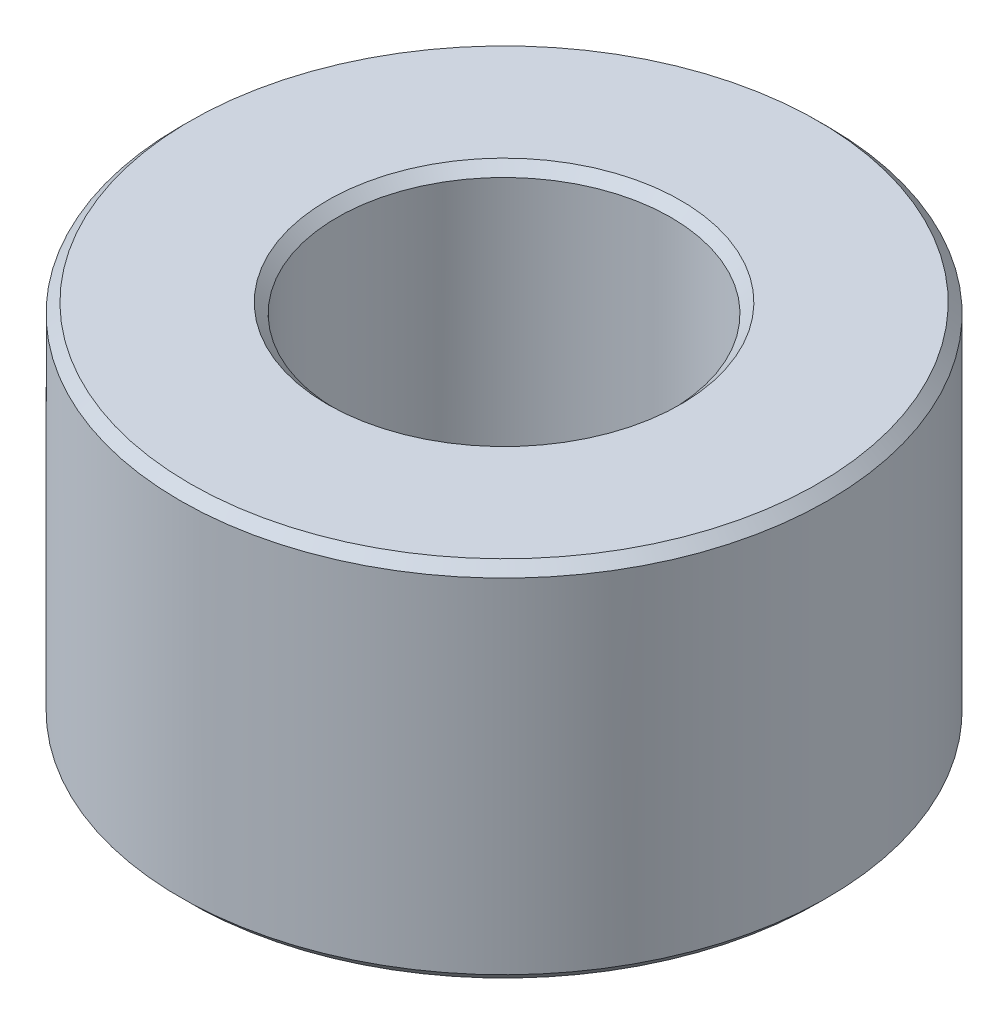
ISO-10303-21;
HEADER;
FILE_DESCRIPTION(('STEP AP214'),'2;1');
FILE_NAME('part.step','',(''),(''),'','','');
FILE_SCHEMA(('AUTOMOTIVE_DESIGN { 1 0 10303 214 1 1 1 1 }'));
ENDSEC;
DATA;
#1=APPLICATION_CONTEXT('core data for automotive mechanical design processes');
#2=APPLICATION_PROTOCOL_DEFINITION('international standard','automotive_design',2000,#1);
#3=PRODUCT_CONTEXT('',#1,'mechanical');
#4=PRODUCT('Part','Part','',(#3));
#5=PRODUCT_RELATED_PRODUCT_CATEGORY('part','',(#4));
#6=PRODUCT_DEFINITION_FORMATION('','',#4);
#7=PRODUCT_DEFINITION_CONTEXT('part definition',#1,'design');
#8=PRODUCT_DEFINITION('design','',#6,#7);
#9=PRODUCT_DEFINITION_SHAPE('','',#8);
#10=(LENGTH_UNIT() NAMED_UNIT(*) SI_UNIT(.MILLI.,.METRE.));
#11=(NAMED_UNIT(*) PLANE_ANGLE_UNIT() SI_UNIT($,.RADIAN.));
#12=(NAMED_UNIT(*) SI_UNIT($,.STERADIAN.) SOLID_ANGLE_UNIT());
#13=UNCERTAINTY_MEASURE_WITH_UNIT(LENGTH_MEASURE(1.E-05),#10,'distance_accuracy_value','');
#14=(GEOMETRIC_REPRESENTATION_CONTEXT(3) GLOBAL_UNCERTAINTY_ASSIGNED_CONTEXT((#13)) GLOBAL_UNIT_ASSIGNED_CONTEXT((#10,
#11,#12)) REPRESENTATION_CONTEXT('',''));
#15=CARTESIAN_POINT('',(0.,0.,0.));
#16=DIRECTION('',(0.,0.,1.));
#17=DIRECTION('',(1.,0.,0.));
#18=AXIS2_PLACEMENT_3D('',#15,#16,#17);
#19=CARTESIAN_POINT('',(0.,15.5,0.));
#20=DIRECTION('',(0.,-1.,0.));
#21=DIRECTION('',(0.,0.,-1.));
#22=AXIS2_PLACEMENT_3D('',#19,#20,#21);
#23=CYLINDRICAL_SURFACE('',#22,8.5);
#24=CARTESIAN_POINT('',(0.,3.00000000000001,0.));
#25=DIRECTION('',(0.,-1.,0.));
#26=DIRECTION('',(0.,0.,-1.));
#27=AXIS2_PLACEMENT_3D('',#24,#25,#26);
#28=CIRCLE('',#27,8.5);
#29=CARTESIAN_POINT('',(0.,3.00000000000001,-8.5));
#30=VERTEX_POINT('',#29);
#31=EDGE_CURVE('E53',#30,#30,#28,.T.);
#32=ORIENTED_EDGE('',*,*,#31,.T.);
#33=EDGE_LOOP('',(#32));
#34=FACE_BOUND('',#33,.T.);
#35=CARTESIAN_POINT('',(0.,15.,0.));
#36=DIRECTION('',(0.,1.,0.));
#37=DIRECTION('',(0.,0.,1.));
#38=AXIS2_PLACEMENT_3D('',#35,#36,#37);
#39=CIRCLE('',#38,8.5);
#40=CARTESIAN_POINT('',(0.,15.,8.5));
#41=VERTEX_POINT('',#40);
#42=EDGE_CURVE('E81',#41,#41,#39,.T.);
#43=ORIENTED_EDGE('',*,*,#42,.T.);
#44=EDGE_LOOP('',(#43));
#45=FACE_BOUND('',#44,.T.);
#46=ADVANCED_FACE('F44',(#34,#45),#23,.F.);
#47=CARTESIAN_POINT('',(0.,15.5,0.));
#48=DIRECTION('',(0.,1.,0.));
#49=DIRECTION('',(0.,0.,1.));
#50=AXIS2_PLACEMENT_3D('',#47,#48,#49);
#51=PLANE('',#50);
#52=CARTESIAN_POINT('',(0.,15.5,0.));
#53=DIRECTION('',(0.,1.,0.));
#54=DIRECTION('',(0.,0.,1.));
#55=AXIS2_PLACEMENT_3D('',#52,#53,#54);
#56=CIRCLE('',#55,9.00000000000001);
#57=CARTESIAN_POINT('',(0.,15.5,9.00000000000001));
#58=VERTEX_POINT('',#57);
#59=EDGE_CURVE('E73',#58,#58,#56,.F.);
#60=ORIENTED_EDGE('',*,*,#59,.T.);
#61=EDGE_LOOP('',(#60));
#62=FACE_BOUND('',#61,.T.);
#63=CARTESIAN_POINT('',(0.,15.5,0.));
#64=DIRECTION('',(0.,1.,0.));
#65=DIRECTION('',(0.,0.,1.));
#66=AXIS2_PLACEMENT_3D('',#63,#64,#65);
#67=CIRCLE('',#66,16.);
#68=CARTESIAN_POINT('',(0.,15.5,16.));
#69=VERTEX_POINT('',#68);
#70=EDGE_CURVE('E77',#69,#69,#67,.T.);
#71=ORIENTED_EDGE('',*,*,#70,.T.);
#72=EDGE_LOOP('',(#71));
#73=FACE_BOUND('',#72,.T.);
#74=ADVANCED_FACE('F113',(#62,#73),#51,.T.);
#75=CARTESIAN_POINT('',(0.,15.5,0.));
#76=DIRECTION('',(0.,-1.,0.));
#77=DIRECTION('',(0.,0.,-1.));
#78=AXIS2_PLACEMENT_3D('',#75,#76,#77);
#79=CYLINDRICAL_SURFACE('',#78,16.5);
#80=CARTESIAN_POINT('',(0.,15.,0.));
#81=DIRECTION('',(0.,1.,0.));
#82=DIRECTION('',(0.,0.,1.));
#83=AXIS2_PLACEMENT_3D('',#80,#81,#82);
#84=CIRCLE('',#83,16.5);
#85=CARTESIAN_POINT('',(0.,15.,16.5));
#86=VERTEX_POINT('',#85);
#87=EDGE_CURVE('E63',#86,#86,#84,.F.);
#88=ORIENTED_EDGE('',*,*,#87,.T.);
#89=EDGE_LOOP('',(#88));
#90=FACE_BOUND('',#89,.T.);
#91=CARTESIAN_POINT('',(0.,-2.49999999999998,0.));
#92=DIRECTION('',(0.,-1.,0.));
#93=DIRECTION('',(0.,0.,-1.));
#94=AXIS2_PLACEMENT_3D('',#91,#92,#93);
#95=CIRCLE('',#94,16.5);
#96=CARTESIAN_POINT('',(0.,-2.49999999999998,-16.5));
#97=VERTEX_POINT('',#96);
#98=EDGE_CURVE('E69',#97,#97,#95,.F.);
#99=ORIENTED_EDGE('',*,*,#98,.T.);
#100=EDGE_LOOP('',(#99));
#101=FACE_BOUND('',#100,.T.);
#102=ADVANCED_FACE('F118',(#90,#101),#79,.T.);
#103=CARTESIAN_POINT('',(0.,1.,0.));
#104=DIRECTION('',(0.,-1.,0.));
#105=DIRECTION('',(0.,0.,-1.));
#106=AXIS2_PLACEMENT_3D('',#103,#104,#105);
#107=PLANE('',#106);
#108=CARTESIAN_POINT('',(0.,1.,0.));
#109=DIRECTION('',(0.,-1.,0.));
#110=DIRECTION('',(0.,0.,-1.));
#111=AXIS2_PLACEMENT_3D('',#108,#109,#110);
#112=CIRCLE('',#111,6.50000000000001);
#113=CARTESIAN_POINT('',(0.,1.,-6.50000000000001));
#114=VERTEX_POINT('',#113);
#115=EDGE_CURVE('E10',#114,#114,#112,.F.);
#116=ORIENTED_EDGE('',*,*,#115,.T.);
#117=EDGE_LOOP('',(#116));
#118=FACE_BOUND('',#117,.T.);
#119=CARTESIAN_POINT('',(0.,1.,0.));
#120=DIRECTION('',(0.,-1.,0.));
#121=DIRECTION('',(0.,0.,-1.));
#122=AXIS2_PLACEMENT_3D('',#119,#120,#121);
#123=CIRCLE('',#122,2.15);
#124=CARTESIAN_POINT('',(0.,1.,-2.15));
#125=VERTEX_POINT('',#124);
#126=EDGE_CURVE('E85',#125,#125,#123,.T.);
#127=ORIENTED_EDGE('',*,*,#126,.T.);
#128=EDGE_LOOP('',(#127));
#129=FACE_BOUND('',#128,.T.);
#130=ADVANCED_FACE('F108',(#118,#129),#107,.F.);
#131=CARTESIAN_POINT('',(0.,1.,0.));
#132=DIRECTION('',(0.,-1.,0.));
#133=DIRECTION('',(0.,0.,-1.));
#134=AXIS2_PLACEMENT_3D('',#131,#132,#133);
#135=CYLINDRICAL_SURFACE('',#134,2.15);
#136=ORIENTED_EDGE('',*,*,#126,.F.);
#137=EDGE_LOOP('',(#136));
#138=FACE_BOUND('',#137,.T.);
#139=CARTESIAN_POINT('',(0.,-3.,0.));
#140=DIRECTION('',(0.,-1.,0.));
#141=DIRECTION('',(0.,0.,-1.));
#142=AXIS2_PLACEMENT_3D('',#139,#140,#141);
#143=CIRCLE('',#142,2.15);
#144=CARTESIAN_POINT('',(0.,-3.,-2.15));
#145=VERTEX_POINT('',#144);
#146=EDGE_CURVE('E89',#145,#145,#143,.T.);
#147=ORIENTED_EDGE('',*,*,#146,.T.);
#148=EDGE_LOOP('',(#147));
#149=FACE_BOUND('',#148,.T.);
#150=ADVANCED_FACE('F94',(#138,#149),#135,.F.);
#151=CARTESIAN_POINT('',(0.,-3.,0.));
#152=DIRECTION('',(0.,-1.,0.));
#153=DIRECTION('',(0.,0.,-1.));
#154=AXIS2_PLACEMENT_3D('',#151,#152,#153);
#155=PLANE('',#154);
#156=CARTESIAN_POINT('',(0.,-3.,0.));
#157=DIRECTION('',(0.,-1.,0.));
#158=DIRECTION('',(0.,0.,-1.));
#159=AXIS2_PLACEMENT_3D('',#156,#157,#158);
#160=CIRCLE('',#159,16.);
#161=CARTESIAN_POINT('',(0.,-3.,-16.));
#162=VERTEX_POINT('',#161);
#163=EDGE_CURVE('E58',#162,#162,#160,.T.);
#164=ORIENTED_EDGE('',*,*,#163,.T.);
#165=EDGE_LOOP('',(#164));
#166=FACE_BOUND('',#165,.T.);
#167=ORIENTED_EDGE('',*,*,#146,.F.);
#168=EDGE_LOOP('',(#167));
#169=FACE_BOUND('',#168,.T.);
#170=ADVANCED_FACE('F96',(#166,#169),#155,.T.);
#171=CARTESIAN_POINT('',(0.,15.,0.));
#172=DIRECTION('',(0.,1.,0.));
#173=DIRECTION('',(0.,0.,1.));
#174=AXIS2_PLACEMENT_3D('',#171,#172,#173);
#175=CONICAL_SURFACE('',#174,8.5,0.785398163397453);
#176=ORIENTED_EDGE('',*,*,#59,.F.);
#177=EDGE_LOOP('',(#176));
#178=FACE_BOUND('',#177,.T.);
#179=ORIENTED_EDGE('',*,*,#42,.F.);
#180=EDGE_LOOP('',(#179));
#181=FACE_BOUND('',#180,.T.);
#182=ADVANCED_FACE('F98',(#178,#181),#175,.F.);
#183=CARTESIAN_POINT('',(0.,15.5,0.));
#184=DIRECTION('',(0.,-1.,0.));
#185=DIRECTION('',(0.,0.,-1.));
#186=AXIS2_PLACEMENT_3D('',#183,#184,#185);
#187=CONICAL_SURFACE('',#186,16.,0.785398163397435);
#188=ORIENTED_EDGE('',*,*,#87,.F.);
#189=EDGE_LOOP('',(#188));
#190=FACE_BOUND('',#189,.T.);
#191=ORIENTED_EDGE('',*,*,#70,.F.);
#192=EDGE_LOOP('',(#191));
#193=FACE_BOUND('',#192,.T.);
#194=ADVANCED_FACE('F105',(#190,#193),#187,.T.);
#195=CARTESIAN_POINT('',(0.,-3.,0.));
#196=DIRECTION('',(0.,1.,0.));
#197=DIRECTION('',(0.,0.,1.));
#198=AXIS2_PLACEMENT_3D('',#195,#196,#197);
#199=CONICAL_SURFACE('',#198,16.,0.785398163397435);
#200=ORIENTED_EDGE('',*,*,#98,.F.);
#201=EDGE_LOOP('',(#200));
#202=FACE_BOUND('',#201,.T.);
#203=ORIENTED_EDGE('',*,*,#163,.F.);
#204=EDGE_LOOP('',(#203));
#205=FACE_BOUND('',#204,.T.);
#206=ADVANCED_FACE('F134',(#202,#205),#199,.T.);
#207=CARTESIAN_POINT('',(0.,3.00000000000001,0.));
#208=DIRECTION('',(0.,1.,0.));
#209=DIRECTION('',(0.,0.,1.));
#210=AXIS2_PLACEMENT_3D('',#207,#208,#209);
#211=CONICAL_SURFACE('',#210,8.5,0.785398163397443);
#212=ORIENTED_EDGE('',*,*,#115,.F.);
#213=EDGE_LOOP('',(#212));
#214=FACE_BOUND('',#213,.T.);
#215=ORIENTED_EDGE('',*,*,#31,.F.);
#216=EDGE_LOOP('',(#215));
#217=FACE_BOUND('',#216,.T.);
#218=ADVANCED_FACE('F47',(#214,#217),#211,.F.);
#219=CLOSED_SHELL('',(#46,#74,#102,#130,#150,#170,#182,#194,#206,#218));
#220=MANIFOLD_SOLID_BREP('B2',#219);
#221=ADVANCED_BREP_SHAPE_REPRESENTATION('',(#18,#220),#14);
#222=SHAPE_DEFINITION_REPRESENTATION(#9,#221);
ENDSEC;
END-ISO-10303-21;
